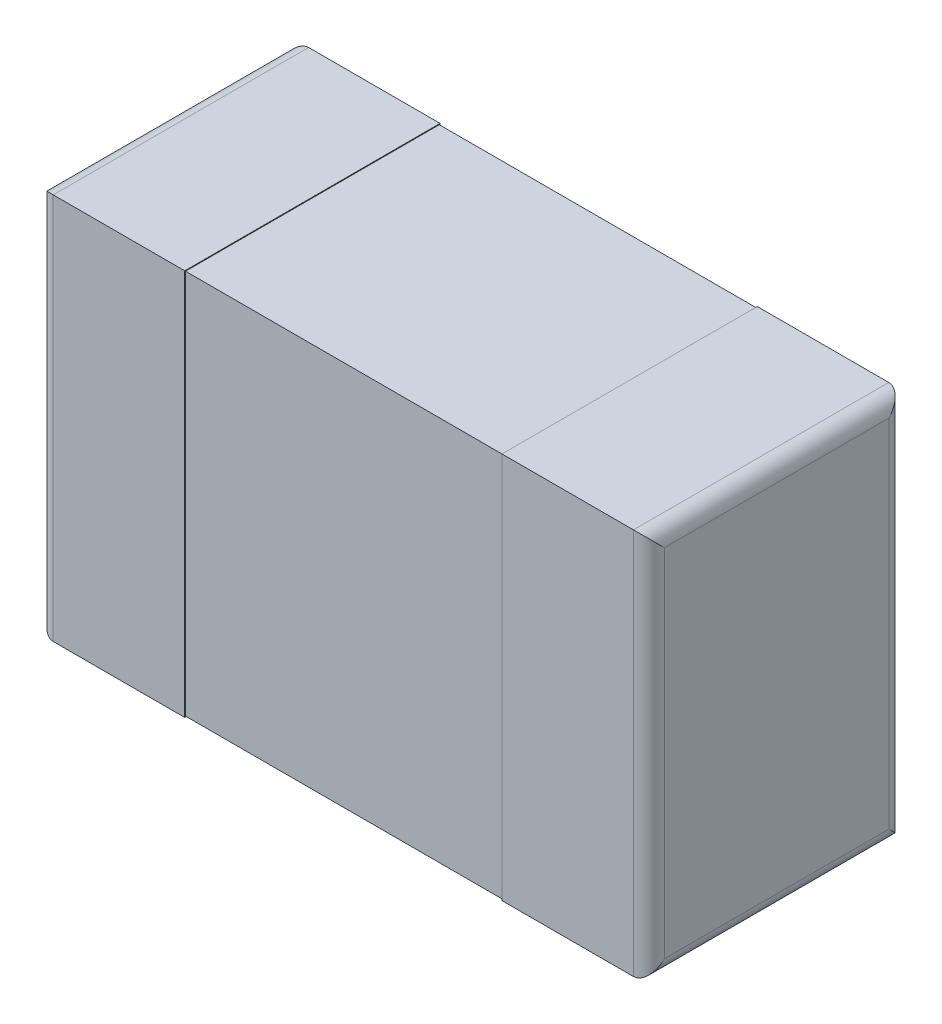
ISO-10303-21;
HEADER;
FILE_DESCRIPTION(('STEP AP214'),'2;1');
FILE_NAME('part.step','',(''),(''),'','','');
FILE_SCHEMA(('AUTOMOTIVE_DESIGN { 1 0 10303 214 1 1 1 1 }'));
ENDSEC;
DATA;
#1=APPLICATION_CONTEXT('core data for automotive mechanical design processes');
#2=APPLICATION_PROTOCOL_DEFINITION('international standard','automotive_design',2000,#1);
#3=PRODUCT_CONTEXT('',#1,'mechanical');
#4=PRODUCT('Part','Part','',(#3));
#5=PRODUCT_RELATED_PRODUCT_CATEGORY('part','',(#4));
#6=PRODUCT_DEFINITION_FORMATION('','',#4);
#7=PRODUCT_DEFINITION_CONTEXT('part definition',#1,'design');
#8=PRODUCT_DEFINITION('design','',#6,#7);
#9=PRODUCT_DEFINITION_SHAPE('','',#8);
#10=(LENGTH_UNIT() NAMED_UNIT(*) SI_UNIT(.MILLI.,.METRE.));
#11=(NAMED_UNIT(*) PLANE_ANGLE_UNIT() SI_UNIT($,.RADIAN.));
#12=(NAMED_UNIT(*) SI_UNIT($,.STERADIAN.) SOLID_ANGLE_UNIT());
#13=UNCERTAINTY_MEASURE_WITH_UNIT(LENGTH_MEASURE(1.E-05),#10,'distance_accuracy_value','');
#14=(GEOMETRIC_REPRESENTATION_CONTEXT(3) GLOBAL_UNCERTAINTY_ASSIGNED_CONTEXT((#13)) GLOBAL_UNIT_ASSIGNED_CONTEXT((#10,
#11,#12)) REPRESENTATION_CONTEXT('',''));
#15=CARTESIAN_POINT('',(0.,0.,0.));
#16=DIRECTION('',(0.,0.,1.));
#17=DIRECTION('',(1.,0.,0.));
#18=AXIS2_PLACEMENT_3D('',#15,#16,#17);
#19=CARTESIAN_POINT('',(0.,0.,0.));
#20=DIRECTION('',(0.,0.,1.));
#21=DIRECTION('',(1.,0.,0.));
#22=AXIS2_PLACEMENT_3D('',#19,#20,#21);
#23=PLANE('',#22);
#24=DIRECTION('',(-1.,0.,0.));
#25=VECTOR('',#24,1.);
#26=CARTESIAN_POINT('',(2.0066,1.27,0.));
#27=LINE('',#26,#25);
#28=CARTESIAN_POINT('',(1.9558,1.27,0.));
#29=VERTEX_POINT('',#28);
#30=CARTESIAN_POINT('',(1.524,1.27,0.));
#31=VERTEX_POINT('',#30);
#32=EDGE_CURVE('E42',#29,#31,#27,.T.);
#33=ORIENTED_EDGE('',*,*,#32,.F.);
#34=DIRECTION('',(0.,-1.,0.));
#35=VECTOR('',#34,1.);
#36=CARTESIAN_POINT('',(1.9558,0.,0.));
#37=LINE('',#36,#35);
#38=CARTESIAN_POINT('',(1.9558,0.,0.));
#39=VERTEX_POINT('',#38);
#40=EDGE_CURVE('E11',#29,#39,#37,.T.);
#41=ORIENTED_EDGE('',*,*,#40,.T.);
#42=DIRECTION('',(1.,0.,0.));
#43=VECTOR('',#42,1.);
#44=CARTESIAN_POINT('',(0.,0.,0.));
#45=LINE('',#44,#43);
#46=CARTESIAN_POINT('',(1.524,0.,0.));
#47=VERTEX_POINT('',#46);
#48=EDGE_CURVE('E261',#47,#39,#45,.T.);
#49=ORIENTED_EDGE('',*,*,#48,.F.);
#50=DIRECTION('',(0.,1.,0.));
#51=VECTOR('',#50,1.);
#52=CARTESIAN_POINT('',(1.524,0.,0.));
#53=LINE('',#52,#51);
#54=EDGE_CURVE('E29',#47,#31,#53,.T.);
#55=ORIENTED_EDGE('',*,*,#54,.T.);
#56=EDGE_LOOP('',(#33,#41,#49,#55));
#57=FACE_BOUND('',#56,.T.);
#58=ADVANCED_FACE('F18',(#57),#23,.F.);
#59=CARTESIAN_POINT('',(0.,0.,0.));
#60=DIRECTION('',(0.,0.,1.));
#61=DIRECTION('',(1.,0.,0.));
#62=AXIS2_PLACEMENT_3D('',#59,#60,#61);
#63=PLANE('',#62);
#64=DIRECTION('',(1.,0.,0.));
#65=VECTOR('',#64,1.);
#66=CARTESIAN_POINT('',(0.,0.,0.));
#67=LINE('',#66,#65);
#68=CARTESIAN_POINT('',(0.0508,0.,0.));
#69=VERTEX_POINT('',#68);
#70=CARTESIAN_POINT('',(0.4826,0.,0.));
#71=VERTEX_POINT('',#70);
#72=EDGE_CURVE('E319',#69,#71,#67,.T.);
#73=ORIENTED_EDGE('',*,*,#72,.F.);
#74=DIRECTION('',(0.,1.,0.));
#75=VECTOR('',#74,1.);
#76=CARTESIAN_POINT('',(0.0508,0.,0.));
#77=LINE('',#76,#75);
#78=CARTESIAN_POINT('',(0.0508,1.27,0.));
#79=VERTEX_POINT('',#78);
#80=EDGE_CURVE('E218',#69,#79,#77,.T.);
#81=ORIENTED_EDGE('',*,*,#80,.T.);
#82=DIRECTION('',(-1.,0.,0.));
#83=VECTOR('',#82,1.);
#84=CARTESIAN_POINT('',(2.0066,1.27,0.));
#85=LINE('',#84,#83);
#86=CARTESIAN_POINT('',(0.4826,1.27,0.));
#87=VERTEX_POINT('',#86);
#88=EDGE_CURVE('E247',#87,#79,#85,.T.);
#89=ORIENTED_EDGE('',*,*,#88,.F.);
#90=DIRECTION('',(0.,-1.,0.));
#91=VECTOR('',#90,1.);
#92=CARTESIAN_POINT('',(0.4826,0.,0.));
#93=LINE('',#92,#91);
#94=EDGE_CURVE('E272',#87,#71,#93,.T.);
#95=ORIENTED_EDGE('',*,*,#94,.T.);
#96=EDGE_LOOP('',(#73,#81,#89,#95));
#97=FACE_BOUND('',#96,.T.);
#98=ADVANCED_FACE('F387',(#97),#63,.F.);
#99=CARTESIAN_POINT('',(1.524,0.00254000000000009,-1.68265745417451));
#100=DIRECTION('',(0.,1.,0.));
#101=DIRECTION('',(1.,0.,0.));
#102=AXIS2_PLACEMENT_3D('',#99,#100,#101);
#103=PLANE('',#102);
#104=DIRECTION('',(-1.,0.,0.));
#105=VECTOR('',#104,1.);
#106=CARTESIAN_POINT('',(1.524,0.00254000000000009,0.00253999999999988));
#107=LINE('',#106,#105);
#108=CARTESIAN_POINT('',(1.524,0.00254000000000009,0.0025399999999999));
#109=VERTEX_POINT('',#108);
#110=CARTESIAN_POINT('',(0.4826,0.00254000000000009,0.0025399999999999));
#111=VERTEX_POINT('',#110);
#112=EDGE_CURVE('E313',#109,#111,#107,.T.);
#113=ORIENTED_EDGE('',*,*,#112,.F.);
#114=DIRECTION('',(0.,0.,1.));
#115=VECTOR('',#114,1.);
#116=CARTESIAN_POINT('',(1.524,0.00254000000000009,-1.68265745417451));
#117=LINE('',#116,#115);
#118=CARTESIAN_POINT('',(1.524,0.00254000000000009,0.83566));
#119=VERTEX_POINT('',#118);
#120=EDGE_CURVE('E348',#109,#119,#117,.T.);
#121=ORIENTED_EDGE('',*,*,#120,.T.);
#122=DIRECTION('',(-1.,0.,0.));
#123=VECTOR('',#122,1.);
#124=CARTESIAN_POINT('',(1.524,0.00254000000000009,0.83566));
#125=LINE('',#124,#123);
#126=CARTESIAN_POINT('',(0.4826,0.00254,0.83566));
#127=VERTEX_POINT('',#126);
#128=EDGE_CURVE('E337',#119,#127,#125,.T.);
#129=ORIENTED_EDGE('',*,*,#128,.T.);
#130=DIRECTION('',(0.,0.,1.));
#131=VECTOR('',#130,1.);
#132=CARTESIAN_POINT('',(0.4826,0.00254,-1.68265745417451));
#133=LINE('',#132,#131);
#134=EDGE_CURVE('E331',#111,#127,#133,.T.);
#135=ORIENTED_EDGE('',*,*,#134,.F.);
#136=EDGE_LOOP('',(#113,#121,#129,#135));
#137=FACE_BOUND('',#136,.T.);
#138=ADVANCED_FACE('F420',(#137),#103,.F.);
#139=CARTESIAN_POINT('',(0.4826,1.26746,-1.68265745417451));
#140=DIRECTION('',(0.,-1.,0.));
#141=DIRECTION('',(0.,0.,-1.));
#142=AXIS2_PLACEMENT_3D('',#139,#140,#141);
#143=PLANE('',#142);
#144=DIRECTION('',(1.,0.,0.));
#145=VECTOR('',#144,1.);
#146=CARTESIAN_POINT('',(0.4826,1.26746,0.00253999999999988));
#147=LINE('',#146,#145);
#148=CARTESIAN_POINT('',(0.4826,1.26746,0.0025399999999999));
#149=VERTEX_POINT('',#148);
#150=CARTESIAN_POINT('',(1.524,1.26746,0.0025399999999999));
#151=VERTEX_POINT('',#150);
#152=EDGE_CURVE('E306',#149,#151,#147,.T.);
#153=ORIENTED_EDGE('',*,*,#152,.F.);
#154=DIRECTION('',(0.,0.,1.));
#155=VECTOR('',#154,1.);
#156=CARTESIAN_POINT('',(0.4826,1.26746,-1.68265745417451));
#157=LINE('',#156,#155);
#158=CARTESIAN_POINT('',(0.4826,1.26746,0.83566));
#159=VERTEX_POINT('',#158);
#160=EDGE_CURVE('E282',#149,#159,#157,.T.);
#161=ORIENTED_EDGE('',*,*,#160,.T.);
#162=DIRECTION('',(1.,0.,0.));
#163=VECTOR('',#162,1.);
#164=CARTESIAN_POINT('',(0.4826,1.26746,0.83566));
#165=LINE('',#164,#163);
#166=CARTESIAN_POINT('',(1.524,1.26746,0.83566));
#167=VERTEX_POINT('',#166);
#168=EDGE_CURVE('E275',#159,#167,#165,.T.);
#169=ORIENTED_EDGE('',*,*,#168,.T.);
#170=DIRECTION('',(0.,0.,1.));
#171=VECTOR('',#170,1.);
#172=CARTESIAN_POINT('',(1.524,1.26746,-1.68265745417451));
#173=LINE('',#172,#171);
#174=EDGE_CURVE('E22',#151,#167,#173,.T.);
#175=ORIENTED_EDGE('',*,*,#174,.F.);
#176=EDGE_LOOP('',(#153,#161,#169,#175));
#177=FACE_BOUND('',#176,.T.);
#178=ADVANCED_FACE('F20',(#177),#143,.F.);
#179=CARTESIAN_POINT('',(2.0066,1.27,0.8382));
#180=DIRECTION('',(0.,-1.,0.));
#181=DIRECTION('',(0.,0.,-1.));
#182=AXIS2_PLACEMENT_3D('',#179,#180,#181);
#183=PLANE('',#182);
#184=DIRECTION('',(-1.,0.,0.));
#185=VECTOR('',#184,1.);
#186=CARTESIAN_POINT('',(2.0066,1.27,0.8382));
#187=LINE('',#186,#185);
#188=CARTESIAN_POINT('',(1.9558,1.27,0.8382));
#189=VERTEX_POINT('',#188);
#190=CARTESIAN_POINT('',(1.524,1.27,0.8382));
#191=VERTEX_POINT('',#190);
#192=EDGE_CURVE('E297',#189,#191,#187,.T.);
#193=ORIENTED_EDGE('',*,*,#192,.F.);
#194=DIRECTION('',(0.,0.,-1.));
#195=VECTOR('',#194,1.);
#196=CARTESIAN_POINT('',(1.9558,1.27,0.8382));
#197=LINE('',#196,#195);
#198=EDGE_CURVE('E273',#189,#29,#197,.T.);
#199=ORIENTED_EDGE('',*,*,#198,.T.);
#200=ORIENTED_EDGE('',*,*,#32,.T.);
#201=DIRECTION('',(0.,0.,1.));
#202=VECTOR('',#201,1.);
#203=CARTESIAN_POINT('',(1.524,1.27,0.83566));
#204=LINE('',#203,#202);
#205=EDGE_CURVE('E252',#31,#191,#204,.T.);
#206=ORIENTED_EDGE('',*,*,#205,.T.);
#207=EDGE_LOOP('',(#193,#199,#200,#206));
#208=FACE_BOUND('',#207,.T.);
#209=ADVANCED_FACE('F285',(#208),#183,.F.);
#210=CARTESIAN_POINT('',(0.,0.,0.8382));
#211=DIRECTION('',(0.,1.,0.));
#212=DIRECTION('',(1.,0.,0.));
#213=AXIS2_PLACEMENT_3D('',#210,#211,#212);
#214=PLANE('',#213);
#215=DIRECTION('',(1.,0.,0.));
#216=VECTOR('',#215,1.);
#217=CARTESIAN_POINT('',(0.,0.,0.8382));
#218=LINE('',#217,#216);
#219=CARTESIAN_POINT('',(0.0508,0.,0.8382));
#220=VERTEX_POINT('',#219);
#221=CARTESIAN_POINT('',(0.4826,0.,0.8382));
#222=VERTEX_POINT('',#221);
#223=EDGE_CURVE('E327',#220,#222,#218,.T.);
#224=ORIENTED_EDGE('',*,*,#223,.F.);
#225=DIRECTION('',(0.,0.,-1.));
#226=VECTOR('',#225,1.);
#227=CARTESIAN_POINT('',(0.0508,0.,0.8382));
#228=LINE('',#227,#226);
#229=EDGE_CURVE('E255',#220,#69,#228,.T.);
#230=ORIENTED_EDGE('',*,*,#229,.T.);
#231=ORIENTED_EDGE('',*,*,#72,.T.);
#232=DIRECTION('',(0.,0.,1.));
#233=VECTOR('',#232,1.);
#234=CARTESIAN_POINT('',(0.4826,0.,0.83566));
#235=LINE('',#234,#233);
#236=EDGE_CURVE('E265',#71,#222,#235,.T.);
#237=ORIENTED_EDGE('',*,*,#236,.T.);
#238=EDGE_LOOP('',(#224,#230,#231,#237));
#239=FACE_BOUND('',#238,.T.);
#240=ADVANCED_FACE('F390',(#239),#214,.F.);
#241=CARTESIAN_POINT('',(0.,0.,0.8382));
#242=DIRECTION('',(0.,1.,0.));
#243=DIRECTION('',(1.,0.,0.));
#244=AXIS2_PLACEMENT_3D('',#241,#242,#243);
#245=PLANE('',#244);
#246=ORIENTED_EDGE('',*,*,#48,.T.);
#247=DIRECTION('',(0.,0.,1.));
#248=VECTOR('',#247,1.);
#249=CARTESIAN_POINT('',(1.9558,0.,0.8382));
#250=LINE('',#249,#248);
#251=CARTESIAN_POINT('',(1.9558,0.,0.8382));
#252=VERTEX_POINT('',#251);
#253=EDGE_CURVE('E266',#39,#252,#250,.T.);
#254=ORIENTED_EDGE('',*,*,#253,.T.);
#255=DIRECTION('',(1.,0.,0.));
#256=VECTOR('',#255,1.);
#257=CARTESIAN_POINT('',(0.,0.,0.8382));
#258=LINE('',#257,#256);
#259=CARTESIAN_POINT('',(1.524,0.,0.8382));
#260=VERTEX_POINT('',#259);
#261=EDGE_CURVE('E257',#260,#252,#258,.T.);
#262=ORIENTED_EDGE('',*,*,#261,.F.);
#263=DIRECTION('',(0.,0.,1.));
#264=VECTOR('',#263,1.);
#265=CARTESIAN_POINT('',(1.524,0.,0.83566));
#266=LINE('',#265,#264);
#267=EDGE_CURVE('E293',#47,#260,#266,.T.);
#268=ORIENTED_EDGE('',*,*,#267,.F.);
#269=EDGE_LOOP('',(#246,#254,#262,#268));
#270=FACE_BOUND('',#269,.T.);
#271=ADVANCED_FACE('F497',(#270),#245,.F.);
#272=CARTESIAN_POINT('',(2.0066,1.27,0.8382));
#273=DIRECTION('',(0.,-1.,0.));
#274=DIRECTION('',(0.,0.,-1.));
#275=AXIS2_PLACEMENT_3D('',#272,#273,#274);
#276=PLANE('',#275);
#277=ORIENTED_EDGE('',*,*,#88,.T.);
#278=DIRECTION('',(0.,0.,1.));
#279=VECTOR('',#278,1.);
#280=CARTESIAN_POINT('',(0.0508,1.27,0.8382));
#281=LINE('',#280,#279);
#282=CARTESIAN_POINT('',(0.0508,1.27,0.8382));
#283=VERTEX_POINT('',#282);
#284=EDGE_CURVE('E245',#79,#283,#281,.T.);
#285=ORIENTED_EDGE('',*,*,#284,.T.);
#286=DIRECTION('',(-1.,0.,0.));
#287=VECTOR('',#286,1.);
#288=CARTESIAN_POINT('',(2.0066,1.27,0.8382));
#289=LINE('',#288,#287);
#290=CARTESIAN_POINT('',(0.4826,1.27,0.8382));
#291=VERTEX_POINT('',#290);
#292=EDGE_CURVE('E248',#291,#283,#289,.T.);
#293=ORIENTED_EDGE('',*,*,#292,.F.);
#294=DIRECTION('',(0.,0.,1.));
#295=VECTOR('',#294,1.);
#296=CARTESIAN_POINT('',(0.4826,1.27,0.83566));
#297=LINE('',#296,#295);
#298=EDGE_CURVE('E148',#87,#291,#297,.T.);
#299=ORIENTED_EDGE('',*,*,#298,.F.);
#300=EDGE_LOOP('',(#277,#285,#293,#299));
#301=FACE_BOUND('',#300,.T.);
#302=ADVANCED_FACE('F404',(#301),#276,.F.);
#303=CARTESIAN_POINT('',(0.,0.,0.8382));
#304=DIRECTION('',(0.,0.,1.));
#305=DIRECTION('',(1.,0.,0.));
#306=AXIS2_PLACEMENT_3D('',#303,#304,#305);
#307=PLANE('',#306);
#308=ORIENTED_EDGE('',*,*,#292,.T.);
#309=DIRECTION('',(0.,-1.,0.));
#310=VECTOR('',#309,1.);
#311=CARTESIAN_POINT('',(0.0508,0.,0.8382));
#312=LINE('',#311,#310);
#313=EDGE_CURVE('E160',#283,#220,#312,.T.);
#314=ORIENTED_EDGE('',*,*,#313,.T.);
#315=ORIENTED_EDGE('',*,*,#223,.T.);
#316=DIRECTION('',(0.,1.,0.));
#317=VECTOR('',#316,1.);
#318=CARTESIAN_POINT('',(0.4826,0.,0.8382));
#319=LINE('',#318,#317);
#320=EDGE_CURVE('E260',#222,#291,#319,.T.);
#321=ORIENTED_EDGE('',*,*,#320,.T.);
#322=EDGE_LOOP('',(#308,#314,#315,#321));
#323=FACE_BOUND('',#322,.T.);
#324=ADVANCED_FACE('F484',(#323),#307,.T.);
#325=CARTESIAN_POINT('',(0.,0.,0.8382));
#326=DIRECTION('',(0.,0.,1.));
#327=DIRECTION('',(1.,0.,0.));
#328=AXIS2_PLACEMENT_3D('',#325,#326,#327);
#329=PLANE('',#328);
#330=ORIENTED_EDGE('',*,*,#261,.T.);
#331=DIRECTION('',(0.,1.,0.));
#332=VECTOR('',#331,1.);
#333=CARTESIAN_POINT('',(1.9558,1.27,0.8382));
#334=LINE('',#333,#332);
#335=EDGE_CURVE('E200',#252,#189,#334,.T.);
#336=ORIENTED_EDGE('',*,*,#335,.T.);
#337=ORIENTED_EDGE('',*,*,#192,.T.);
#338=DIRECTION('',(0.,-1.,0.));
#339=VECTOR('',#338,1.);
#340=CARTESIAN_POINT('',(1.524,1.27,0.8382));
#341=LINE('',#340,#339);
#342=EDGE_CURVE('E269',#191,#260,#341,.T.);
#343=ORIENTED_EDGE('',*,*,#342,.T.);
#344=EDGE_LOOP('',(#330,#336,#337,#343));
#345=FACE_BOUND('',#344,.T.);
#346=ADVANCED_FACE('F429',(#345),#329,.T.);
#347=CARTESIAN_POINT('',(0.,1.27,0.8382));
#348=DIRECTION('',(1.,0.,0.));
#349=DIRECTION('',(0.,1.,0.));
#350=AXIS2_PLACEMENT_3D('',#347,#348,#349);
#351=PLANE('',#350);
#352=DIRECTION('',(0.,-1.,0.));
#353=VECTOR('',#352,1.);
#354=CARTESIAN_POINT('',(0.,1.27,0.0508));
#355=LINE('',#354,#353);
#356=CARTESIAN_POINT('',(0.,1.2192,0.0508));
#357=VERTEX_POINT('',#356);
#358=CARTESIAN_POINT('',(0.,0.0508,0.0508));
#359=VERTEX_POINT('',#358);
#360=EDGE_CURVE('E230',#357,#359,#355,.T.);
#361=ORIENTED_EDGE('',*,*,#360,.T.);
#362=DIRECTION('',(0.,0.,1.));
#363=VECTOR('',#362,1.);
#364=CARTESIAN_POINT('',(0.,0.0508,0.8382));
#365=LINE('',#364,#363);
#366=CARTESIAN_POINT('',(0.,0.0508,0.7874));
#367=VERTEX_POINT('',#366);
#368=EDGE_CURVE('E222',#359,#367,#365,.T.);
#369=ORIENTED_EDGE('',*,*,#368,.T.);
#370=DIRECTION('',(0.,1.,0.));
#371=VECTOR('',#370,1.);
#372=CARTESIAN_POINT('',(0.,1.27,0.7874));
#373=LINE('',#372,#371);
#374=CARTESIAN_POINT('',(0.,1.2192,0.7874));
#375=VERTEX_POINT('',#374);
#376=EDGE_CURVE('E219',#367,#375,#373,.T.);
#377=ORIENTED_EDGE('',*,*,#376,.T.);
#378=DIRECTION('',(0.,0.,-1.));
#379=VECTOR('',#378,1.);
#380=CARTESIAN_POINT('',(0.,1.2192,0.8382));
#381=LINE('',#380,#379);
#382=EDGE_CURVE('E223',#375,#357,#381,.T.);
#383=ORIENTED_EDGE('',*,*,#382,.T.);
#384=EDGE_LOOP('',(#361,#369,#377,#383));
#385=FACE_BOUND('',#384,.T.);
#386=ADVANCED_FACE('F399',(#385),#351,.F.);
#387=CARTESIAN_POINT('',(2.0066,0.,0.8382));
#388=DIRECTION('',(-1.,0.,0.));
#389=DIRECTION('',(0.,0.,1.));
#390=AXIS2_PLACEMENT_3D('',#387,#388,#389);
#391=PLANE('',#390);
#392=DIRECTION('',(0.,1.,0.));
#393=VECTOR('',#392,1.);
#394=CARTESIAN_POINT('',(2.0066,0.,0.0508));
#395=LINE('',#394,#393);
#396=CARTESIAN_POINT('',(2.0066,0.0508,0.0508));
#397=VERTEX_POINT('',#396);
#398=CARTESIAN_POINT('',(2.0066,1.2192,0.0508));
#399=VERTEX_POINT('',#398);
#400=EDGE_CURVE('E233',#397,#399,#395,.T.);
#401=ORIENTED_EDGE('',*,*,#400,.T.);
#402=DIRECTION('',(0.,0.,1.));
#403=VECTOR('',#402,1.);
#404=CARTESIAN_POINT('',(2.0066,1.2192,0.8382));
#405=LINE('',#404,#403);
#406=CARTESIAN_POINT('',(2.0066,1.2192,0.7874));
#407=VERTEX_POINT('',#406);
#408=EDGE_CURVE('E192',#399,#407,#405,.T.);
#409=ORIENTED_EDGE('',*,*,#408,.T.);
#410=DIRECTION('',(0.,-1.,0.));
#411=VECTOR('',#410,1.);
#412=CARTESIAN_POINT('',(2.0066,0.,0.7874));
#413=LINE('',#412,#411);
#414=CARTESIAN_POINT('',(2.0066,0.0508,0.7874));
#415=VERTEX_POINT('',#414);
#416=EDGE_CURVE('E186',#407,#415,#413,.T.);
#417=ORIENTED_EDGE('',*,*,#416,.T.);
#418=DIRECTION('',(0.,0.,-1.));
#419=VECTOR('',#418,1.);
#420=CARTESIAN_POINT('',(2.0066,0.0508,0.8382));
#421=LINE('',#420,#419);
#422=EDGE_CURVE('E175',#415,#397,#421,.T.);
#423=ORIENTED_EDGE('',*,*,#422,.T.);
#424=EDGE_LOOP('',(#401,#409,#417,#423));
#425=FACE_BOUND('',#424,.T.);
#426=ADVANCED_FACE('F190',(#425),#391,.F.);
#427=CARTESIAN_POINT('',(0.4826,0.,0.83566));
#428=DIRECTION('',(1.,0.,0.));
#429=DIRECTION('',(0.,1.,0.));
#430=AXIS2_PLACEMENT_3D('',#427,#428,#429);
#431=PLANE('',#430);
#432=ORIENTED_EDGE('',*,*,#160,.F.);
#433=DIRECTION('',(0.,-1.,0.));
#434=VECTOR('',#433,1.);
#435=CARTESIAN_POINT('',(0.4826,2.51831745417451,0.0025399999999999));
#436=LINE('',#435,#434);
#437=EDGE_CURVE('E187',#149,#111,#436,.T.);
#438=ORIENTED_EDGE('',*,*,#437,.T.);
#439=ORIENTED_EDGE('',*,*,#134,.T.);
#440=DIRECTION('',(0.,1.,0.));
#441=VECTOR('',#440,1.);
#442=CARTESIAN_POINT('',(0.4826,0.,0.83566));
#443=LINE('',#442,#441);
#444=EDGE_CURVE('E356',#127,#159,#443,.T.);
#445=ORIENTED_EDGE('',*,*,#444,.T.);
#446=EDGE_LOOP('',(#432,#438,#439,#445));
#447=FACE_BOUND('',#446,.T.);
#448=ORIENTED_EDGE('',*,*,#298,.T.);
#449=ORIENTED_EDGE('',*,*,#320,.F.);
#450=ORIENTED_EDGE('',*,*,#236,.F.);
#451=ORIENTED_EDGE('',*,*,#94,.F.);
#452=EDGE_LOOP('',(#448,#449,#450,#451));
#453=FACE_BOUND('',#452,.T.);
#454=ADVANCED_FACE('F388',(#447,#453),#431,.T.);
#455=CARTESIAN_POINT('',(1.524,1.27,0.83566));
#456=DIRECTION('',(-1.,0.,0.));
#457=DIRECTION('',(0.,0.,1.));
#458=AXIS2_PLACEMENT_3D('',#455,#456,#457);
#459=PLANE('',#458);
#460=DIRECTION('',(0.,-1.,0.));
#461=VECTOR('',#460,1.);
#462=CARTESIAN_POINT('',(1.524,2.51831745417451,0.0025399999999999));
#463=LINE('',#462,#461);
#464=EDGE_CURVE('E341',#151,#109,#463,.T.);
#465=ORIENTED_EDGE('',*,*,#464,.F.);
#466=ORIENTED_EDGE('',*,*,#174,.T.);
#467=DIRECTION('',(0.,-1.,0.));
#468=VECTOR('',#467,1.);
#469=CARTESIAN_POINT('',(1.524,1.27,0.83566));
#470=LINE('',#469,#468);
#471=EDGE_CURVE('E312',#167,#119,#470,.T.);
#472=ORIENTED_EDGE('',*,*,#471,.T.);
#473=ORIENTED_EDGE('',*,*,#120,.F.);
#474=EDGE_LOOP('',(#465,#466,#472,#473));
#475=FACE_BOUND('',#474,.T.);
#476=ORIENTED_EDGE('',*,*,#267,.T.);
#477=ORIENTED_EDGE('',*,*,#342,.F.);
#478=ORIENTED_EDGE('',*,*,#205,.F.);
#479=ORIENTED_EDGE('',*,*,#54,.F.);
#480=EDGE_LOOP('',(#476,#477,#478,#479));
#481=FACE_BOUND('',#480,.T.);
#482=ADVANCED_FACE('F291',(#475,#481),#459,.T.);
#483=CARTESIAN_POINT('',(0.,0.,0.83566));
#484=DIRECTION('',(0.,0.,-1.));
#485=DIRECTION('',(0.,-1.,0.));
#486=AXIS2_PLACEMENT_3D('',#483,#484,#485);
#487=PLANE('',#486);
#488=ORIENTED_EDGE('',*,*,#471,.F.);
#489=ORIENTED_EDGE('',*,*,#168,.F.);
#490=ORIENTED_EDGE('',*,*,#444,.F.);
#491=ORIENTED_EDGE('',*,*,#128,.F.);
#492=EDGE_LOOP('',(#488,#489,#490,#491));
#493=FACE_BOUND('',#492,.T.);
#494=ADVANCED_FACE('F417',(#493),#487,.F.);
#495=CARTESIAN_POINT('',(0.4826,2.51831745417451,0.0025399999999999));
#496=DIRECTION('',(0.,0.,-1.));
#497=DIRECTION('',(0.,-1.,0.));
#498=AXIS2_PLACEMENT_3D('',#495,#496,#497);
#499=PLANE('',#498);
#500=ORIENTED_EDGE('',*,*,#112,.T.);
#501=ORIENTED_EDGE('',*,*,#437,.F.);
#502=ORIENTED_EDGE('',*,*,#152,.T.);
#503=ORIENTED_EDGE('',*,*,#464,.T.);
#504=EDGE_LOOP('',(#500,#501,#502,#503));
#505=FACE_BOUND('',#504,.T.);
#506=ADVANCED_FACE('F422',(#505),#499,.T.);
#507=CARTESIAN_POINT('',(0.0508,1.2192,0.8382));
#508=DIRECTION('',(0.,0.,-1.));
#509=DIRECTION('',(-1.,0.,0.));
#510=AXIS2_PLACEMENT_3D('',#507,#508,#509);
#511=CYLINDRICAL_SURFACE('',#510,0.0508);
#512=CARTESIAN_POINT('',(0.0508,1.2192,0.0508));
#513=DIRECTION('',(0.,-0.707106781186548,-0.707106781186548));
#514=DIRECTION('',(0.,0.707106781186548,-0.707106781186548));
#515=AXIS2_PLACEMENT_3D('',#512,#513,#514);
#516=ELLIPSE('',#515,0.0718420489685533,0.0508);
#517=EDGE_CURVE('E323',#357,#79,#516,.T.);
#518=ORIENTED_EDGE('',*,*,#517,.F.);
#519=ORIENTED_EDGE('',*,*,#382,.F.);
#520=CARTESIAN_POINT('',(0.0508,1.2192,0.7874));
#521=DIRECTION('',(0.,-0.707106781186548,0.707106781186548));
#522=DIRECTION('',(0.,-0.707106781186548,-0.707106781186548));
#523=AXIS2_PLACEMENT_3D('',#520,#521,#522);
#524=ELLIPSE('',#523,0.0718420489685533,0.0508);
#525=EDGE_CURVE('E345',#283,#375,#524,.T.);
#526=ORIENTED_EDGE('',*,*,#525,.F.);
#527=ORIENTED_EDGE('',*,*,#284,.F.);
#528=EDGE_LOOP('',(#518,#519,#526,#527));
#529=FACE_BOUND('',#528,.T.);
#530=ADVANCED_FACE('F401',(#529),#511,.T.);
#531=CARTESIAN_POINT('',(0.0508,0.,0.7874));
#532=DIRECTION('',(0.,1.,0.));
#533=DIRECTION('',(-1.,0.,0.));
#534=AXIS2_PLACEMENT_3D('',#531,#532,#533);
#535=CYLINDRICAL_SURFACE('',#534,0.0508);
#536=ORIENTED_EDGE('',*,*,#525,.T.);
#537=ORIENTED_EDGE('',*,*,#376,.F.);
#538=CARTESIAN_POINT('',(0.0508,0.0508,0.7874));
#539=DIRECTION('',(0.,-0.707106781186548,-0.707106781186548));
#540=DIRECTION('',(0.,0.707106781186548,-0.707106781186548));
#541=AXIS2_PLACEMENT_3D('',#538,#539,#540);
#542=ELLIPSE('',#541,0.0718420489685533,0.0508);
#543=EDGE_CURVE('E210',#220,#367,#542,.T.);
#544=ORIENTED_EDGE('',*,*,#543,.F.);
#545=ORIENTED_EDGE('',*,*,#313,.F.);
#546=EDGE_LOOP('',(#536,#537,#544,#545));
#547=FACE_BOUND('',#546,.T.);
#548=ADVANCED_FACE('F518',(#547),#535,.T.);
#549=CARTESIAN_POINT('',(0.0508,1.27,0.0508));
#550=DIRECTION('',(0.,-1.,0.));
#551=DIRECTION('',(1.,0.,0.));
#552=AXIS2_PLACEMENT_3D('',#549,#550,#551);
#553=CYLINDRICAL_SURFACE('',#552,0.0508);
#554=ORIENTED_EDGE('',*,*,#517,.T.);
#555=ORIENTED_EDGE('',*,*,#80,.F.);
#556=CARTESIAN_POINT('',(0.0508,0.0508,0.0508));
#557=DIRECTION('',(0.,-0.707106781186548,0.707106781186548));
#558=DIRECTION('',(0.,-0.707106781186548,-0.707106781186548));
#559=AXIS2_PLACEMENT_3D('',#556,#557,#558);
#560=ELLIPSE('',#559,0.0718420489685533,0.0508);
#561=EDGE_CURVE('E203',#359,#69,#560,.T.);
#562=ORIENTED_EDGE('',*,*,#561,.F.);
#563=ORIENTED_EDGE('',*,*,#360,.F.);
#564=EDGE_LOOP('',(#554,#555,#562,#563));
#565=FACE_BOUND('',#564,.T.);
#566=ADVANCED_FACE('F396',(#565),#553,.T.);
#567=CARTESIAN_POINT('',(0.0508,0.0508,0.8382));
#568=DIRECTION('',(0.,0.,-1.));
#569=DIRECTION('',(-1.,0.,0.));
#570=AXIS2_PLACEMENT_3D('',#567,#568,#569);
#571=CYLINDRICAL_SURFACE('',#570,0.0508);
#572=ORIENTED_EDGE('',*,*,#543,.T.);
#573=ORIENTED_EDGE('',*,*,#368,.F.);
#574=ORIENTED_EDGE('',*,*,#561,.T.);
#575=ORIENTED_EDGE('',*,*,#229,.F.);
#576=EDGE_LOOP('',(#572,#573,#574,#575));
#577=FACE_BOUND('',#576,.T.);
#578=ADVANCED_FACE('F398',(#577),#571,.T.);
#579=CARTESIAN_POINT('',(1.9558,0.0508,0.8382));
#580=DIRECTION('',(0.,0.,-1.));
#581=DIRECTION('',(-1.,0.,0.));
#582=AXIS2_PLACEMENT_3D('',#579,#580,#581);
#583=CYLINDRICAL_SURFACE('',#582,0.0508);
#584=CARTESIAN_POINT('',(1.9558,0.0508,0.0508));
#585=DIRECTION('',(0.,0.707106781186548,-0.707106781186548));
#586=DIRECTION('',(0.,-0.707106781186548,-0.707106781186548));
#587=AXIS2_PLACEMENT_3D('',#584,#585,#586);
#588=ELLIPSE('',#587,0.0718420489685533,0.0508);
#589=EDGE_CURVE('E181',#397,#39,#588,.T.);
#590=ORIENTED_EDGE('',*,*,#589,.F.);
#591=ORIENTED_EDGE('',*,*,#422,.F.);
#592=CARTESIAN_POINT('',(1.9558,0.0508,0.7874));
#593=DIRECTION('',(0.,0.707106781186548,0.707106781186548));
#594=DIRECTION('',(0.,0.707106781186548,-0.707106781186548));
#595=AXIS2_PLACEMENT_3D('',#592,#593,#594);
#596=ELLIPSE('',#595,0.0718420489685533,0.0508);
#597=EDGE_CURVE('E179',#252,#415,#596,.T.);
#598=ORIENTED_EDGE('',*,*,#597,.F.);
#599=ORIENTED_EDGE('',*,*,#253,.F.);
#600=EDGE_LOOP('',(#590,#591,#598,#599));
#601=FACE_BOUND('',#600,.T.);
#602=ADVANCED_FACE('F177',(#601),#583,.T.);
#603=CARTESIAN_POINT('',(1.9558,0.,0.7874));
#604=DIRECTION('',(0.,-1.,0.));
#605=DIRECTION('',(0.,0.,-1.));
#606=AXIS2_PLACEMENT_3D('',#603,#604,#605);
#607=CYLINDRICAL_SURFACE('',#606,0.0508);
#608=ORIENTED_EDGE('',*,*,#597,.T.);
#609=ORIENTED_EDGE('',*,*,#416,.F.);
#610=CARTESIAN_POINT('',(1.9558,1.2192,0.7874));
#611=DIRECTION('',(0.,0.707106781186548,-0.707106781186548));
#612=DIRECTION('',(0.,-0.707106781186548,-0.707106781186548));
#613=AXIS2_PLACEMENT_3D('',#610,#611,#612);
#614=ELLIPSE('',#613,0.0718420489685533,0.0508);
#615=EDGE_CURVE('E213',#189,#407,#614,.T.);
#616=ORIENTED_EDGE('',*,*,#615,.F.);
#617=ORIENTED_EDGE('',*,*,#335,.F.);
#618=EDGE_LOOP('',(#608,#609,#616,#617));
#619=FACE_BOUND('',#618,.T.);
#620=ADVANCED_FACE('F198',(#619),#607,.T.);
#621=CARTESIAN_POINT('',(1.9558,0.,0.0508));
#622=DIRECTION('',(0.,1.,0.));
#623=DIRECTION('',(0.,0.,1.));
#624=AXIS2_PLACEMENT_3D('',#621,#622,#623);
#625=CYLINDRICAL_SURFACE('',#624,0.0508);
#626=ORIENTED_EDGE('',*,*,#589,.T.);
#627=ORIENTED_EDGE('',*,*,#40,.F.);
#628=CARTESIAN_POINT('',(1.9558,1.2192,0.0508));
#629=DIRECTION('',(0.,0.707106781186548,0.707106781186548));
#630=DIRECTION('',(0.,0.707106781186548,-0.707106781186548));
#631=AXIS2_PLACEMENT_3D('',#628,#629,#630);
#632=ELLIPSE('',#631,0.0718420489685533,0.0508);
#633=EDGE_CURVE('E309',#399,#29,#632,.T.);
#634=ORIENTED_EDGE('',*,*,#633,.F.);
#635=ORIENTED_EDGE('',*,*,#400,.F.);
#636=EDGE_LOOP('',(#626,#627,#634,#635));
#637=FACE_BOUND('',#636,.T.);
#638=ADVANCED_FACE('F434',(#637),#625,.T.);
#639=CARTESIAN_POINT('',(1.9558,1.2192,0.8382));
#640=DIRECTION('',(0.,0.,-1.));
#641=DIRECTION('',(-1.,0.,0.));
#642=AXIS2_PLACEMENT_3D('',#639,#640,#641);
#643=CYLINDRICAL_SURFACE('',#642,0.0508);
#644=ORIENTED_EDGE('',*,*,#615,.T.);
#645=ORIENTED_EDGE('',*,*,#408,.F.);
#646=ORIENTED_EDGE('',*,*,#633,.T.);
#647=ORIENTED_EDGE('',*,*,#198,.F.);
#648=EDGE_LOOP('',(#644,#645,#646,#647));
#649=FACE_BOUND('',#648,.T.);
#650=ADVANCED_FACE('F431',(#649),#643,.T.);
#651=CLOSED_SHELL('',(#58,#98,#138,#178,#209,#240,#271,#302,#324,#346,#386,#426,#454,#482,#494,
#506,#530,#548,#566,#578,#602,#620,#638,#650));
#652=MANIFOLD_SOLID_BREP('B1',#651);
#653=ADVANCED_BREP_SHAPE_REPRESENTATION('',(#18,#652),#14);
#654=SHAPE_DEFINITION_REPRESENTATION(#9,#653);
ENDSEC;
END-ISO-10303-21;
